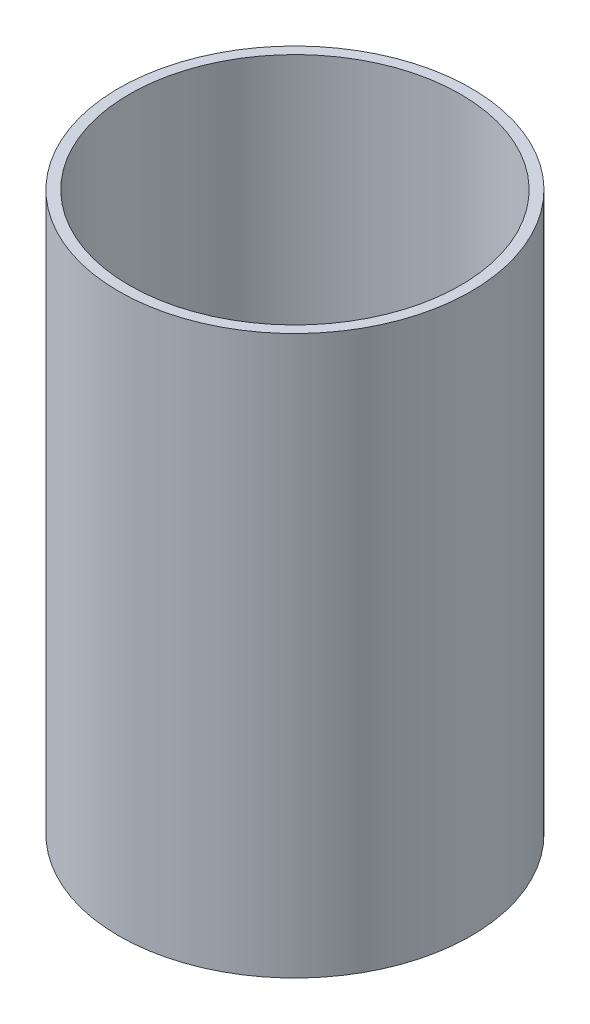
ISO-10303-21;
HEADER;
FILE_DESCRIPTION(('STEP AP214'),'2;1');
FILE_NAME('part.step','',(''),(''),'','','');
FILE_SCHEMA(('AUTOMOTIVE_DESIGN { 1 0 10303 214 1 1 1 1 }'));
ENDSEC;
DATA;
#1=APPLICATION_CONTEXT('core data for automotive mechanical design processes');
#2=APPLICATION_PROTOCOL_DEFINITION('international standard','automotive_design',2000,#1);
#3=PRODUCT_CONTEXT('',#1,'mechanical');
#4=PRODUCT('Part','Part','',(#3));
#5=PRODUCT_RELATED_PRODUCT_CATEGORY('part','',(#4));
#6=PRODUCT_DEFINITION_FORMATION('','',#4);
#7=PRODUCT_DEFINITION_CONTEXT('part definition',#1,'design');
#8=PRODUCT_DEFINITION('design','',#6,#7);
#9=PRODUCT_DEFINITION_SHAPE('','',#8);
#10=(LENGTH_UNIT() NAMED_UNIT(*) SI_UNIT(.MILLI.,.METRE.));
#11=(NAMED_UNIT(*) PLANE_ANGLE_UNIT() SI_UNIT($,.RADIAN.));
#12=(NAMED_UNIT(*) SI_UNIT($,.STERADIAN.) SOLID_ANGLE_UNIT());
#13=UNCERTAINTY_MEASURE_WITH_UNIT(LENGTH_MEASURE(1.E-05),#10,'distance_accuracy_value','');
#14=(GEOMETRIC_REPRESENTATION_CONTEXT(3) GLOBAL_UNCERTAINTY_ASSIGNED_CONTEXT((#13)) GLOBAL_UNIT_ASSIGNED_CONTEXT((#10,
#11,#12)) REPRESENTATION_CONTEXT('',''));
#15=CARTESIAN_POINT('',(0.,0.,0.));
#16=DIRECTION('',(0.,0.,1.));
#17=DIRECTION('',(1.,0.,0.));
#18=AXIS2_PLACEMENT_3D('',#15,#16,#17);
#19=CARTESIAN_POINT('',(0.,79.8,0.));
#20=DIRECTION('',(0.,1.,0.));
#21=DIRECTION('',(0.,0.,1.));
#22=AXIS2_PLACEMENT_3D('',#19,#20,#21);
#23=PLANE('',#22);
#24=CARTESIAN_POINT('',(0.,79.8,0.));
#25=DIRECTION('',(0.,1.,0.));
#26=DIRECTION('',(0.,0.,1.));
#27=AXIS2_PLACEMENT_3D('',#24,#25,#26);
#28=CIRCLE('',#27,25.175);
#29=CARTESIAN_POINT('',(0.,79.8,25.175));
#30=VERTEX_POINT('',#29);
#31=EDGE_CURVE('E10',#30,#30,#28,.T.);
#32=ORIENTED_EDGE('',*,*,#31,.T.);
#33=EDGE_LOOP('',(#32));
#34=FACE_BOUND('',#33,.T.);
#35=CARTESIAN_POINT('',(0.,79.8,0.));
#36=DIRECTION('',(0.,1.,0.));
#37=DIRECTION('',(0.,0.,1.));
#38=AXIS2_PLACEMENT_3D('',#35,#36,#37);
#39=CIRCLE('',#38,23.675);
#40=CARTESIAN_POINT('',(0.,79.8,23.675));
#41=VERTEX_POINT('',#40);
#42=EDGE_CURVE('E50',#41,#41,#39,.T.);
#43=ORIENTED_EDGE('',*,*,#42,.F.);
#44=EDGE_LOOP('',(#43));
#45=FACE_BOUND('',#44,.T.);
#46=ADVANCED_FACE('F37',(#34,#45),#23,.T.);
#47=CARTESIAN_POINT('',(0.,0.,0.));
#48=DIRECTION('',(0.,1.,0.));
#49=DIRECTION('',(0.,0.,1.));
#50=AXIS2_PLACEMENT_3D('',#47,#48,#49);
#51=PLANE('',#50);
#52=CARTESIAN_POINT('',(0.,0.,0.));
#53=DIRECTION('',(0.,1.,0.));
#54=DIRECTION('',(0.,0.,1.));
#55=AXIS2_PLACEMENT_3D('',#52,#53,#54);
#56=CIRCLE('',#55,25.175);
#57=CARTESIAN_POINT('',(0.,0.,25.175));
#58=VERTEX_POINT('',#57);
#59=EDGE_CURVE('E41',#58,#58,#56,.T.);
#60=ORIENTED_EDGE('',*,*,#59,.F.);
#61=EDGE_LOOP('',(#60));
#62=FACE_BOUND('',#61,.T.);
#63=CARTESIAN_POINT('',(0.,0.,0.));
#64=DIRECTION('',(0.,1.,0.));
#65=DIRECTION('',(0.,0.,1.));
#66=AXIS2_PLACEMENT_3D('',#63,#64,#65);
#67=CIRCLE('',#66,23.675);
#68=CARTESIAN_POINT('',(0.,0.,23.675));
#69=VERTEX_POINT('',#68);
#70=EDGE_CURVE('E52',#69,#69,#67,.T.);
#71=ORIENTED_EDGE('',*,*,#70,.T.);
#72=EDGE_LOOP('',(#71));
#73=FACE_BOUND('',#72,.T.);
#74=ADVANCED_FACE('F64',(#62,#73),#51,.F.);
#75=CARTESIAN_POINT('',(0.,79.8,0.));
#76=DIRECTION('',(0.,-1.,0.));
#77=DIRECTION('',(0.,0.,-1.));
#78=AXIS2_PLACEMENT_3D('',#75,#76,#77);
#79=CYLINDRICAL_SURFACE('',#78,25.175);
#80=ORIENTED_EDGE('',*,*,#31,.F.);
#81=EDGE_LOOP('',(#80));
#82=FACE_BOUND('',#81,.T.);
#83=ORIENTED_EDGE('',*,*,#59,.T.);
#84=EDGE_LOOP('',(#83));
#85=FACE_BOUND('',#84,.T.);
#86=ADVANCED_FACE('F39',(#82,#85),#79,.T.);
#87=CARTESIAN_POINT('',(0.,79.8,0.));
#88=DIRECTION('',(0.,-1.,0.));
#89=DIRECTION('',(0.,0.,-1.));
#90=AXIS2_PLACEMENT_3D('',#87,#88,#89);
#91=CYLINDRICAL_SURFACE('',#90,23.675);
#92=ORIENTED_EDGE('',*,*,#42,.T.);
#93=EDGE_LOOP('',(#92));
#94=FACE_BOUND('',#93,.T.);
#95=ORIENTED_EDGE('',*,*,#70,.F.);
#96=EDGE_LOOP('',(#95));
#97=FACE_BOUND('',#96,.T.);
#98=ADVANCED_FACE('F60',(#94,#97),#91,.F.);
#99=CLOSED_SHELL('',(#46,#74,#86,#98));
#100=MANIFOLD_SOLID_BREP('B2',#99);
#101=ADVANCED_BREP_SHAPE_REPRESENTATION('',(#18,#100),#14);
#102=SHAPE_DEFINITION_REPRESENTATION(#9,#101);
ENDSEC;
END-ISO-10303-21;
